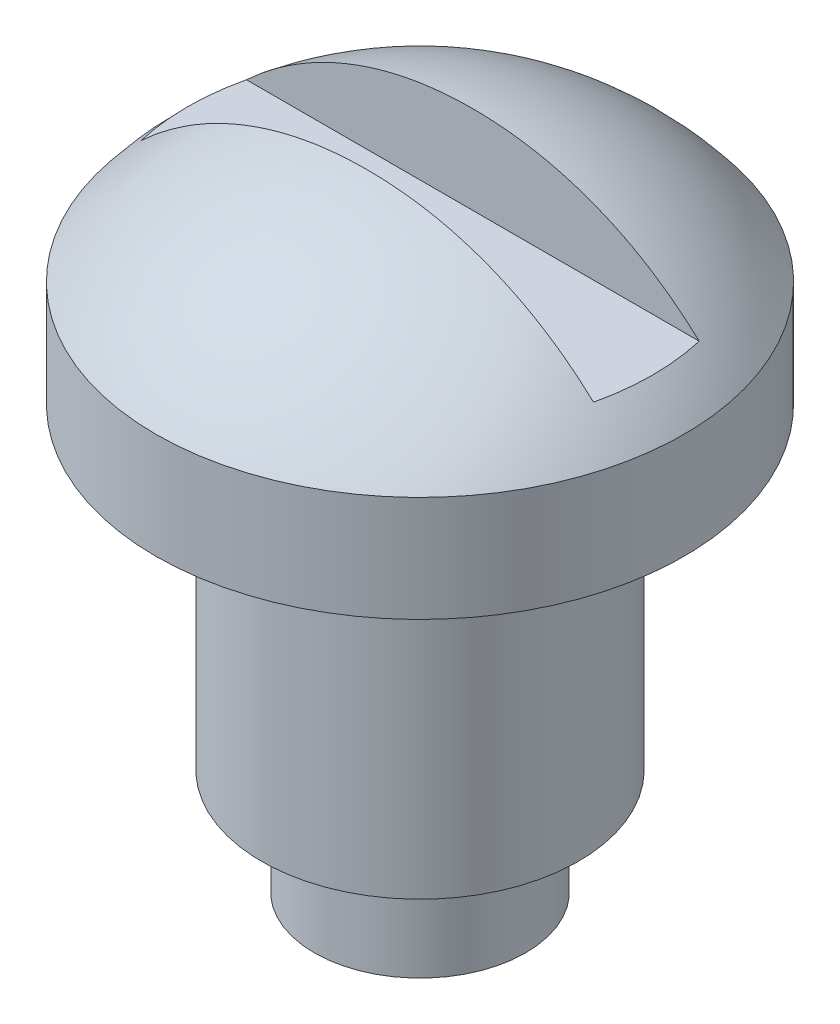
ISO-10303-21;
HEADER;
FILE_DESCRIPTION(('STEP AP214'),'2;1');
FILE_NAME('part.step','',(''),(''),'','','');
FILE_SCHEMA(('AUTOMOTIVE_DESIGN { 1 0 10303 214 1 1 1 1 }'));
ENDSEC;
DATA;
#1=APPLICATION_CONTEXT('core data for automotive mechanical design processes');
#2=APPLICATION_PROTOCOL_DEFINITION('international standard','automotive_design',2000,#1);
#3=PRODUCT_CONTEXT('',#1,'mechanical');
#4=PRODUCT('Part','Part','',(#3));
#5=PRODUCT_RELATED_PRODUCT_CATEGORY('part','',(#4));
#6=PRODUCT_DEFINITION_FORMATION('','',#4);
#7=PRODUCT_DEFINITION_CONTEXT('part definition',#1,'design');
#8=PRODUCT_DEFINITION('design','',#6,#7);
#9=PRODUCT_DEFINITION_SHAPE('','',#8);
#10=(LENGTH_UNIT() NAMED_UNIT(*) SI_UNIT(.MILLI.,.METRE.));
#11=(NAMED_UNIT(*) PLANE_ANGLE_UNIT() SI_UNIT($,.RADIAN.));
#12=(NAMED_UNIT(*) SI_UNIT($,.STERADIAN.) SOLID_ANGLE_UNIT());
#13=UNCERTAINTY_MEASURE_WITH_UNIT(LENGTH_MEASURE(1.E-05),#10,'distance_accuracy_value','');
#14=(GEOMETRIC_REPRESENTATION_CONTEXT(3) GLOBAL_UNCERTAINTY_ASSIGNED_CONTEXT((#13)) GLOBAL_UNIT_ASSIGNED_CONTEXT((#10,
#11,#12)) REPRESENTATION_CONTEXT('',''));
#15=CARTESIAN_POINT('',(0.,0.,0.));
#16=DIRECTION('',(0.,0.,1.));
#17=DIRECTION('',(1.,0.,0.));
#18=AXIS2_PLACEMENT_3D('',#15,#16,#17);
#19=CARTESIAN_POINT('',(0.,6.20081280988914,0.));
#20=DIRECTION('',(0.,-1.,0.));
#21=DIRECTION('',(0.,0.,-1.));
#22=AXIS2_PLACEMENT_3D('',#19,#20,#21);
#23=DEGENERATE_TOROIDAL_SURFACE('',#22,0.100390148746788,6.2,.T.);
#24=CARTESIAN_POINT('',(0.,10.,0.));
#25=DIRECTION('',(0.,-1.,0.));
#26=DIRECTION('',(0.,0.,-1.));
#27=AXIS2_PLACEMENT_3D('',#24,#25,#26);
#28=CIRCLE('',#27,5.);
#29=CARTESIAN_POINT('',(0.,10.,-5.));
#30=VERTEX_POINT('',#29);
#31=EDGE_CURVE('E76',#30,#30,#28,.T.);
#32=ORIENTED_EDGE('',*,*,#31,.F.);
#33=EDGE_LOOP('',(#32));
#34=FACE_BOUND('',#33,.T.);
#35=CARTESIAN_POINT('',(-2.61237037580595,11.7835604228593,-1.));
#36=CARTESIAN_POINT('',(-2.45382282538688,11.8550890441978,-1.));
#37=CARTESIAN_POINT('',(-2.29225280769405,11.9198766114603,-1.));
#38=CARTESIAN_POINT('',(-1.96421876722474,12.0355643245258,-1.));
#39=CARTESIAN_POINT('',(-1.79775503524373,12.0864652936613,-1.));
#40=CARTESIAN_POINT('',(-1.4607970651705,12.1742007818954,-1.));
#41=CARTESIAN_POINT('',(-1.29029516516596,12.2110058283417,-1.));
#42=CARTESIAN_POINT('',(-0.94683377857503,12.2703524347939,-1.));
#43=CARTESIAN_POINT('',(-0.773874260330649,12.2928938108907,-1.));
#44=CARTESIAN_POINT('',(-0.425657388377293,12.3241854876249,-1.));
#45=CARTESIAN_POINT('',(-0.250392442994169,12.3328499748018,-1.));
#46=CARTESIAN_POINT('',(0.100289915669181,12.3367231669148,-1.));
#47=CARTESIAN_POINT('',(0.275707335981193,12.3319312143195,-1.));
#48=CARTESIAN_POINT('',(0.625533362381513,12.3084994279706,-1.));
#49=CARTESIAN_POINT('',(0.799942492464325,12.2898675913701,-1.));
#50=CARTESIAN_POINT('',(1.14661264919242,12.2382300013575,-1.));
#51=CARTESIAN_POINT('',(1.31887389072011,12.2052256978806,-1.));
#52=CARTESIAN_POINT('',(1.66921885918353,12.1226293355474,-1.));
#53=CARTESIAN_POINT('',(1.84711498915365,12.072238086888,-1.));
#54=CARTESIAN_POINT('',(2.19769774738319,11.9556992391668,-1.));
#55=CARTESIAN_POINT('',(2.37038362945118,11.8895493951749,-1.));
#56=CARTESIAN_POINT('',(2.70910778153963,11.7419735468425,-1.));
#57=CARTESIAN_POINT('',(2.87514582456367,11.6605470214049,-1.));
#58=CARTESIAN_POINT('',(3.19919168571218,11.4830588529782,-1.));
#59=CARTESIAN_POINT('',(3.35720022216488,11.3869985222295,-1.));
#60=CARTESIAN_POINT('',(3.65432272918018,11.1874447957869,-1.));
#61=CARTESIAN_POINT('',(3.79400046819442,11.0847893801181,-1.));
#62=CARTESIAN_POINT('',(4.06421129063088,10.867979701022,-1.));
#63=CARTESIAN_POINT('',(4.19474117443749,10.7538214479826,-1.));
#64=CARTESIAN_POINT('',(4.44559886917584,10.5149101654858,-1.));
#65=CARTESIAN_POINT('',(4.56593136829595,10.3901620580381,-1.));
#66=CARTESIAN_POINT('',(4.79563755966596,10.1308714013775,-1.));
#67=CARTESIAN_POINT('',(4.90500720434009,9.99632526607488,-1.));
#68=CARTESIAN_POINT('',(5.11134382797234,9.71925752680546,-1.));
#69=CARTESIAN_POINT('',(5.20837941605125,9.57678700913662,-1.));
#70=CARTESIAN_POINT('',(5.39013109431643,9.28412033326316,-1.));
#71=CARTESIAN_POINT('',(5.47484264493493,9.1339213557133,-1.));
#72=CARTESIAN_POINT('',(5.63126728087798,8.82697779726688,-1.));
#73=CARTESIAN_POINT('',(5.70298562812034,8.67023589787223,-1.));
#74=CARTESIAN_POINT('',(5.83297903520153,8.35120561371858,-1.));
#75=CARTESIAN_POINT('',(5.89124912434938,8.18891520350668,-1.));
#76=CARTESIAN_POINT('',(5.99384129037307,7.86017518411423,-1.));
#77=CARTESIAN_POINT('',(6.03817824838982,7.69373021873843,-1.));
#78=CARTESIAN_POINT('',(6.11268720252436,7.35763480774286,-1.));
#79=CARTESIAN_POINT('',(6.14285396199065,7.1879832011514,-1.));
#80=CARTESIAN_POINT('',(6.18877543933646,6.84680016639743,-1.));
#81=CARTESIAN_POINT('',(6.2045351190965,6.67526940603885,-1.));
#82=CARTESIAN_POINT('',(6.22155129918386,6.33142553396434,-1.));
#83=CARTESIAN_POINT('',(6.22280236916714,6.15911215346403,-1.));
#84=CARTESIAN_POINT('',(6.21078183902495,5.81509226509558,-1.));
#85=CARTESIAN_POINT('',(6.19751860823098,5.6433854647064,-1.));
#86=CARTESIAN_POINT('',(6.1565678431201,5.30162159375661,-1.));
#87=CARTESIAN_POINT('',(6.12887377653486,5.13156530585717,-1.));
#88=CARTESIAN_POINT('',(6.05925621396793,4.79439810866241,-1.));
#89=CARTESIAN_POINT('',(6.01733330878051,4.62728707738037,-1.));
#90=CARTESIAN_POINT('',(5.91957854633249,4.29726637071842,-1.));
#91=CARTESIAN_POINT('',(5.86375299634464,4.13435482702257,-1.));
#92=CARTESIAN_POINT('',(5.73855601781616,3.81374892612541,-1.));
#93=CARTESIAN_POINT('',(5.66917928878027,3.65605663873432,-1.));
#94=CARTESIAN_POINT('',(5.5174163777287,3.34713502840521,-1.));
#95=CARTESIAN_POINT('',(5.43503506867632,3.19590331148161,-1.));
#96=CARTESIAN_POINT('',(5.25778854705118,2.90084405492901,-1.));
#97=CARTESIAN_POINT('',(5.16291744564249,2.75702005275908,-1.));
#98=CARTESIAN_POINT('',(4.96143456651403,2.47792635225774,-1.));
#99=CARTESIAN_POINT('',(4.85482712988464,2.34265351993061,-1.));
#100=CARTESIAN_POINT('',(4.6305306656051,2.08148066721675,-1.));
#101=CARTESIAN_POINT('',(4.51283464580676,1.9555866516502,-1.));
#102=CARTESIAN_POINT('',(4.26730259308499,1.7142036512217,-1.));
#103=CARTESIAN_POINT('',(4.13947030830414,1.59871085367293,-1.));
#104=CARTESIAN_POINT('',(3.87452163126147,1.37888032774053,-1.));
#105=CARTESIAN_POINT('',(3.73740404791095,1.27454403492207,-1.));
#106=CARTESIAN_POINT('',(3.45492878166863,1.07781406201076,-1.));
#107=CARTESIAN_POINT('',(3.3095741357438,0.985416021024321,-1.));
#108=CARTESIAN_POINT('',(3.01144157881078,0.813061759054482,-1.));
#109=CARTESIAN_POINT('',(2.85865524795669,0.733120102856962,-1.));
#110=CARTESIAN_POINT('',(2.54696387804005,0.586382043556859,-1.));
#111=CARTESIAN_POINT('',(2.38806106874604,0.519580903327315,-1.));
#112=CARTESIAN_POINT('',(2.06513470688729,0.399491373249309,-1.));
#113=CARTESIAN_POINT('',(1.90110849529788,0.346210135581787,-1.));
#114=CARTESIAN_POINT('',(1.5692455729522,0.253519570721612,-1.));
#115=CARTESIAN_POINT('',(1.40141016504523,0.214105574454103,-1.));
#116=CARTESIAN_POINT('',(1.06215827195792,0.149050511107759,-1.));
#117=CARTESIAN_POINT('',(0.890727354104403,0.123484878385291,-1.));
#118=CARTESIAN_POINT('',(0.546355247617415,0.0861995570450816,-1.));
#119=CARTESIAN_POINT('',(0.373413803270475,0.0744822604099826,-1.));
#120=CARTESIAN_POINT('',(0.0270775775518827,0.0642579361220109,-1.));
#121=CARTESIAN_POINT('',(-0.146317363956651,0.0657564692472337,-1.));
#122=CARTESIAN_POINT('',(-0.492473261039021,0.0821054443909234,-1.));
#123=CARTESIAN_POINT('',(-0.665234271876585,0.0969546933740604,-1.));
#124=CARTESIAN_POINT('',(-1.02113310718087,0.142166708836785,-1.));
#125=CARTESIAN_POINT('',(-1.20414338821634,0.17354979917317,-1.));
#126=CARTESIAN_POINT('',(-1.56665718479694,0.252493620765257,-1.));
#127=CARTESIAN_POINT('',(-1.74616047621129,0.30005538244251,-1.));
#128=CARTESIAN_POINT('',(-2.10001069616468,0.411084482262799,-1.));
#129=CARTESIAN_POINT('',(-2.27436196458994,0.474537980493747,-1.));
#130=CARTESIAN_POINT('',(-2.61669250238063,0.616951192129823,-1.));
#131=CARTESIAN_POINT('',(-2.78466941071003,0.695916585460378,-1.));
#132=CARTESIAN_POINT('',(-3.10328100801335,0.863712516176362,-1.));
#133=CARTESIAN_POINT('',(-3.25435668537386,0.951707149541059,-1.));
#134=CARTESIAN_POINT('',(-3.54844875087975,1.14026886361712,-1.));
#135=CARTESIAN_POINT('',(-3.69146522656724,1.24083580772508,-1.));
#136=CARTESIAN_POINT('',(-3.96841824880026,1.4538387477368,-1.));
#137=CARTESIAN_POINT('',(-4.10235275348132,1.56627739827634,-1.));
#138=CARTESIAN_POINT('',(-4.36012828326083,1.80219178575983,-1.));
#139=CARTESIAN_POINT('',(-4.48396904337742,1.92566781227962,-1.));
#140=CARTESIAN_POINT('',(-4.71903122311263,2.18100139743122,-1.));
#141=CARTESIAN_POINT('',(-4.83040146781093,2.31272199246409,-1.));
#142=CARTESIAN_POINT('',(-5.0416743212637,2.58513268924456,-1.));
#143=CARTESIAN_POINT('',(-5.14157299731609,2.72582584142182,-1.));
#144=CARTESIAN_POINT('',(-5.32909495751051,3.01506240253884,-1.));
#145=CARTESIAN_POINT('',(-5.41672466473192,3.1636016473504,-1.));
#146=CARTESIAN_POINT('',(-5.57917573209164,3.46759712502422,-1.));
#147=CARTESIAN_POINT('',(-5.65399235340974,3.62305589035154,-1.));
#148=CARTESIAN_POINT('',(-5.7901417426395,3.9394949045904,-1.));
#149=CARTESIAN_POINT('',(-5.85149444118922,4.1004665787412,-1.));
#150=CARTESIAN_POINT('',(-5.96044114426368,4.42706756482144,-1.));
#151=CARTESIAN_POINT('',(-6.0080299947478,4.59269859609514,-1.));
#152=CARTESIAN_POINT('',(-6.08906447318068,4.92732136222522,-1.));
#153=CARTESIAN_POINT('',(-6.12251521993561,5.09631185752013,-1.));
#154=CARTESIAN_POINT('',(-6.1750722182253,5.4365874573456,-1.));
#155=CARTESIAN_POINT('',(-6.1941719625513,5.60787356699664,-1.));
#156=CARTESIAN_POINT('',(-6.2178627183198,5.95140011412864,-1.));
#157=CARTESIAN_POINT('',(-6.22245761171482,6.12364028390921,-1.));
#158=CARTESIAN_POINT('',(-6.21711812388446,6.46781710592616,-1.));
#159=CARTESIAN_POINT('',(-6.20719032657169,6.63975386034217,-1.));
#160=CARTESIAN_POINT('',(-6.17288165844191,6.98224394258609,-1.));
#161=CARTESIAN_POINT('',(-6.14849541518042,7.15279673227112,-1.));
#162=CARTESIAN_POINT('',(-6.08545097066471,7.49117765390956,-1.));
#163=CARTESIAN_POINT('',(-6.04679811192872,7.65900678128222,-1.));
#164=CARTESIAN_POINT('',(-5.95548288225497,7.99085485045835,-1.));
#165=CARTESIAN_POINT('',(-5.90281700073203,8.15487282626915,-1.));
#166=CARTESIAN_POINT('',(-5.78387713885126,8.47782928561231,-1.));
#167=CARTESIAN_POINT('',(-5.71760818798558,8.63676962148333,-1.));
#168=CARTESIAN_POINT('',(-5.57187956663406,8.94859559656203,-1.));
#169=CARTESIAN_POINT('',(-5.49241229908417,9.10147768544957,-1.));
#170=CARTESIAN_POINT('',(-5.32091175263685,9.3999480917538,-1.));
#171=CARTESIAN_POINT('',(-5.2288831116385,9.54553907419289,-1.));
#172=CARTESIAN_POINT('',(-5.03280073134026,9.82858642041928,-1.));
#173=CARTESIAN_POINT('',(-4.92873584577963,9.9660350629403,-1.));
#174=CARTESIAN_POINT('',(-4.70943319341987,10.2316243364121,-1.));
#175=CARTESIAN_POINT('',(-4.59419950714537,10.3597683371103,-1.));
#176=CARTESIAN_POINT('',(-4.35343950586722,10.6058006846382,-1.));
#177=CARTESIAN_POINT('',(-4.2279212379481,10.7236969036752,-1.));
#178=CARTESIAN_POINT('',(-3.96745402155415,10.9484751455599,-1.));
#179=CARTESIAN_POINT('',(-3.83250765188762,11.0553601605919,-1.));
#180=CARTESIAN_POINT('',(-3.52440990209183,11.2789516880712,-1.));
#181=CARTESIAN_POINT('',(-3.34924502199823,11.3928976077583,-1.));
#182=CARTESIAN_POINT('',(-2.98828968281612,11.6023092160345,-1.));
#183=CARTESIAN_POINT('',(-2.80250336847671,11.6977820503726,-1.));
#184=CARTESIAN_POINT('',(-2.61237037580595,11.7835604228593,-1.));
#185=B_SPLINE_CURVE_WITH_KNOTS('',3,(#35,#36,#37,#38,#39,#40,#41,#42,#43,#44,#45,#46,#47,#48,
#49,#50,#51,#52,#53,#54,#55,#56,#57,#58,#59,#60,#61,#62,#63,#64,#65,#66,#67,#68,#69,#70,#71,#72,
#73,#74,#75,#76,#77,#78,#79,#80,#81,#82,#83,#84,#85,#86,#87,#88,#89,#90,#91,#92,#93,#94,#95,#96,
#97,#98,#99,#100,#101,#102,#103,#104,#105,#106,#107,#108,#109,#110,#111,#112,#113,#114,#115,
#116,#117,#118,#119,#120,#121,#122,#123,#124,#125,#126,#127,#128,#129,#130,#131,#132,#133,#134,
#135,#136,#137,#138,#139,#140,#141,#142,#143,#144,#145,#146,#147,#148,#149,#150,#151,#152,#153,
#154,#155,#156,#157,#158,#159,#160,#161,#162,#163,#164,#165,#166,#167,#168,#169,#170,#171,#172,
#173,#174,#175,#176,#177,#178,#179,#180,#181,#182,#183,#184),.UNSPECIFIED.,.T.,.F.,(4,2,2,2,2,2,
2,2,2,2,2,2,2,2,2,2,2,2,2,2,2,2,2,2,2,2,2,2,2,2,2,2,2,2,2,2,2,2,2,2,2,2,2,2,2,2,2,2,2,2,2,2,2,2,
2,2,2,2,2,2,2,2,2,2,2,2,2,2,2,2,2,2,2,2,4),(0.,0.52162227518856,1.04321361681522,
1.56588965722053,2.08857243662882,2.61447513104324,3.14040352345252,3.66602825281899,
4.19159996794679,4.74554010900442,5.29955921023021,5.85359721282877,6.40758556302246,
6.92700159166487,7.44659839731351,7.96595501051616,8.48550267356392,9.00202048969736,
9.5187280864034,10.0352259595933,10.5519144339956,11.0680491740428,11.5843745039015,
12.1005219413,12.6168625583195,13.1329055964285,13.6491824299824,14.1654378298764,
14.6814594432703,15.1976833023292,15.7137141836286,16.2299892465586,16.7460739848268,
17.2624863579175,17.7787086569727,18.2949973012893,18.8110968154156,19.3277953289153,
19.8443072310008,20.3610918067154,20.8777022151169,21.3970990896837,21.9165856650502,
22.4362908333768,22.955949564867,23.512260708605,24.0686072905037,24.6244710318578,
25.1805386921813,25.7044103916849,26.2282763995983,26.7522597984332,27.2762569484981,
27.7931216395524,28.3101629973336,28.8269326520912,29.3438930192743,29.860082889526,
30.3764658038437,30.8926615973777,31.4090913097692,31.9253827976677,32.4414402955425,
32.9576896694586,33.4737459157166,33.9899315678856,34.5059267122729,35.0222199038424,
35.5383229831627,36.0549078894365,36.571304767637,37.0873013847477,37.6031574130237,
38.2289385097988,38.8544770562045),.UNSPECIFIED.);
#186=CARTESIAN_POINT('',(-4.28429457024648,10.6682578494913,-1.));
#187=VERTEX_POINT('',#186);
#188=CARTESIAN_POINT('',(4.28429457024648,10.6682578494913,-1.));
#189=VERTEX_POINT('',#188);
#190=EDGE_CURVE('E59',#187,#189,#185,.T.);
#191=ORIENTED_EDGE('',*,*,#190,.T.);
#192=CARTESIAN_POINT('',(0.,10.6682578494913,0.));
#193=DIRECTION('',(0.,1.,0.));
#194=DIRECTION('',(0.,0.,1.));
#195=AXIS2_PLACEMENT_3D('',#192,#193,#194);
#196=CIRCLE('',#195,4.39945223461324);
#197=CARTESIAN_POINT('',(4.28429457024648,10.6682578494913,1.));
#198=VERTEX_POINT('',#197);
#199=EDGE_CURVE('E74',#198,#189,#196,.T.);
#200=ORIENTED_EDGE('',*,*,#199,.F.);
#201=CARTESIAN_POINT('',(-2.61237037580595,11.7835604228593,1.));
#202=CARTESIAN_POINT('',(-2.76953013446622,11.7126616538096,1.));
#203=CARTESIAN_POINT('',(-2.92367512132521,11.6351581392118,1.));
#204=CARTESIAN_POINT('',(-3.22494424250824,11.4674274884413,1.));
#205=CARTESIAN_POINT('',(-3.37206684969643,11.3771976014232,1.));
#206=CARTESIAN_POINT('',(-3.65829991991208,11.184583651109,1.));
#207=CARTESIAN_POINT('',(-3.79740366312367,11.0821896079795,1.));
#208=CARTESIAN_POINT('',(-4.06652529172736,10.8659893050681,1.));
#209=CARTESIAN_POINT('',(-4.19653986102927,10.7521789166447,1.));
#210=CARTESIAN_POINT('',(-4.44635437421702,10.5141194715528,1.));
#211=CARTESIAN_POINT('',(-4.56616557385356,10.3898822257463,1.));
#212=CARTESIAN_POINT('',(-4.79492184436636,10.1316947313164,1.));
#213=CARTESIAN_POINT('',(-4.90386288556611,9.99774091220772,1.));
#214=CARTESIAN_POINT('',(-5.10998322290083,9.72120363225137,1.));
#215=CARTESIAN_POINT('',(-5.20716996019344,9.57862571763902,1.));
#216=CARTESIAN_POINT('',(-5.38920165250081,9.28572456424802,1.));
#217=CARTESIAN_POINT('',(-5.4740420409007,9.13539848731118,1.));
#218=CARTESIAN_POINT('',(-5.63058307403834,8.8284132359901,1.));
#219=CARTESIAN_POINT('',(-5.70230831388038,8.67176660262545,1.));
#220=CARTESIAN_POINT('',(-5.83233015569767,8.35292837040632,1.));
#221=CARTESIAN_POINT('',(-5.8906217952054,8.19073474778186,1.));
#222=CARTESIAN_POINT('',(-5.99331046011594,7.86206450555485,1.));
#223=CARTESIAN_POINT('',(-6.03771195214065,7.69558928145096,1.));
#224=CARTESIAN_POINT('',(-6.11234341538914,7.35942732295554,1.));
#225=CARTESIAN_POINT('',(-6.1425681454913,7.18973942492632,1.));
#226=CARTESIAN_POINT('',(-6.18858932228113,6.84854632114735,1.));
#227=CARTESIAN_POINT('',(-6.20439643451184,6.6770425538691,1.));
#228=CARTESIAN_POINT('',(-6.22151150217539,6.33324861063383,1.));
#229=CARTESIAN_POINT('',(-6.22281403039831,6.16095816444426,1.));
#230=CARTESIAN_POINT('',(-6.21089903401457,5.81695096598726,1.));
#231=CARTESIAN_POINT('',(-6.19768746543514,5.64523400737728,1.));
#232=CARTESIAN_POINT('',(-6.15683849522704,5.30344557438124,1.));
#233=CARTESIAN_POINT('',(-6.12919455941013,5.13337488088694,1.));
#234=CARTESIAN_POINT('',(-6.05967550743527,4.79617554325779,1.));
#235=CARTESIAN_POINT('',(-6.01780104268923,4.62904676482308,1.));
#236=CARTESIAN_POINT('',(-5.92014103940568,4.29898671134499,1.));
#237=CARTESIAN_POINT('',(-5.86436180986741,4.13605356950894,1.));
#238=CARTESIAN_POINT('',(-5.73925680112486,3.81540521616797,1.));
#239=CARTESIAN_POINT('',(-5.6699260907916,3.65769192857098,1.));
#240=CARTESIAN_POINT('',(-5.51825321323034,3.34872455627066,1.));
#241=CARTESIAN_POINT('',(-5.43591592024914,3.19746807872834,1.));
#242=CARTESIAN_POINT('',(-5.25876194401593,2.90236700656758,1.));
#243=CARTESIAN_POINT('',(-5.1639403236925,2.75852537571567,1.));
#244=CARTESIAN_POINT('',(-4.96255554966216,2.47939167010919,1.));
#245=CARTESIAN_POINT('',(-4.855996737623,2.34409646291985,1.));
#246=CARTESIAN_POINT('',(-4.6318066143536,2.08288618433385,1.));
#247=CARTESIAN_POINT('',(-4.51416932780523,1.95697624134713,1.));
#248=CARTESIAN_POINT('',(-4.26875474951989,1.71555470999595,1.));
#249=CARTESIAN_POINT('',(-4.14098120238977,1.60003931495622,1.));
#250=CARTESIAN_POINT('',(-3.8760402155095,1.38006626584059,1.));
#251=CARTESIAN_POINT('',(-3.73886395024665,1.27561924136626,1.));
#252=CARTESIAN_POINT('',(-3.45625710754308,1.07868131304224,1.));
#253=CARTESIAN_POINT('',(-3.31082957573247,0.986186038461787,1.));
#254=CARTESIAN_POINT('',(-3.01274247120871,0.813769947582478,1.));
#255=CARTESIAN_POINT('',(-2.86008438184039,0.733846566579666,1.));
#256=CARTESIAN_POINT('',(-2.54865448448198,0.587124846120135,1.));
#257=CARTESIAN_POINT('',(-2.38988490966581,0.520321765865855,1.));
#258=CARTESIAN_POINT('',(-2.06703803506578,0.400137221697751,1.));
#259=CARTESIAN_POINT('',(-1.9029521506886,0.346778825727535,1.));
#260=CARTESIAN_POINT('',(-1.5709606048746,0.253945431532434,1.));
#261=CARTESIAN_POINT('',(-1.40305625012743,0.214465757880043,1.));
#262=CARTESIAN_POINT('',(-1.06438842786513,0.149434034288514,1.));
#263=CARTESIAN_POINT('',(-0.893621964484864,0.123897656962984,1.));
#264=CARTESIAN_POINT('',(-0.550557797344773,0.0865571088909178,1.));
#265=CARTESIAN_POINT('',(-0.378259786384644,0.0747557587637779,1.));
#266=CARTESIAN_POINT('',(-0.116749725477367,0.0668406396936543,1.));
#267=CARTESIAN_POINT('',(-0.0276550763777773,0.0659001922612646,1.));
#268=CARTESIAN_POINT('',(0.15050126000954,0.0675050652442816,1.));
#269=CARTESIAN_POINT('',(0.239562947780622,0.0700503323397383,1.));
#270=CARTESIAN_POINT('',(0.50646921698554,0.083003124150141,1.));
#271=CARTESIAN_POINT('',(0.68409063573613,0.098725911403814,1.));
#272=CARTESIAN_POINT('',(1.03727847680897,0.144931043055646,1.));
#273=CARTESIAN_POINT('',(1.21284619769764,0.175403479671435,1.));
#274=CARTESIAN_POINT('',(1.56074755831644,0.251248564664148,1.));
#275=CARTESIAN_POINT('',(1.73308113362178,0.296621509529652,1.));
#276=CARTESIAN_POINT('',(2.07698806362326,0.403250860665653,1.));
#277=CARTESIAN_POINT('',(2.24845868470853,0.464839037380593,1.));
#278=CARTESIAN_POINT('',(2.58527026894938,0.602971003164428,1.));
#279=CARTESIAN_POINT('',(2.750611138907,0.679515019514023,1.));
#280=CARTESIAN_POINT('',(3.07389726048473,0.847013928886992,1.));
#281=CARTESIAN_POINT('',(3.23183994703454,0.937973772893433,1.));
#282=CARTESIAN_POINT('',(3.53900237225522,1.13357830260712,1.));
#283=CARTESIAN_POINT('',(3.68822259695505,1.23822222476269,1.));
#284=CARTESIAN_POINT('',(3.96940116420893,1.45471039765208,1.));
#285=CARTESIAN_POINT('',(4.10185161679123,1.56591633468932,1.));
#286=CARTESIAN_POINT('',(4.35692455980143,1.79916358097327,1.));
#287=CARTESIAN_POINT('',(4.47954382450615,1.92120841912554,1.));
#288=CARTESIAN_POINT('',(4.7139541170938,2.17515518824203,1.));
#289=CARTESIAN_POINT('',(4.82575141322442,2.3070513337883,1.));
#290=CARTESIAN_POINT('',(5.03783656706516,2.57987200429023,1.));
#291=CARTESIAN_POINT('',(5.13812017371303,2.72079983417348,1.));
#292=CARTESIAN_POINT('',(5.32606517302676,3.01010031422378,1.));
#293=CARTESIAN_POINT('',(5.41377142876951,3.15844382202381,1.));
#294=CARTESIAN_POINT('',(5.57640167470215,3.46205007626505,1.));
#295=CARTESIAN_POINT('',(5.65132094678908,3.61731535014343,1.));
#296=CARTESIAN_POINT('',(5.78778016867733,3.93355516112538,1.));
#297=CARTESIAN_POINT('',(5.84932466296181,4.09452773730963,1.));
#298=CARTESIAN_POINT('',(5.95864839108645,4.42114747917068,1.));
#299=CARTESIAN_POINT('',(6.00642253636553,4.58679634811673,1.));
#300=CARTESIAN_POINT('',(6.08779704990877,4.9213781494905,1.));
#301=CARTESIAN_POINT('',(6.12141040840164,5.09030792272112,1.));
#302=CARTESIAN_POINT('',(6.17429732784205,5.43046123243593,1.));
#303=CARTESIAN_POINT('',(6.19356560867202,5.60168558992433,1.));
#304=CARTESIAN_POINT('',(6.21760061455096,5.94508893422134,1.));
#305=CARTESIAN_POINT('',(6.22237239880995,6.11726756697093,1.));
#306=CARTESIAN_POINT('',(6.21739390991926,6.46147473964077,1.));
#307=CARTESIAN_POINT('',(6.20763858612897,6.63350320654432,1.));
#308=CARTESIAN_POINT('',(6.17367087976165,6.97607815943759,1.));
#309=CARTESIAN_POINT('',(6.14946254524917,7.14662504683009,1.));
#310=CARTESIAN_POINT('',(6.08676449519221,7.48507317220452,1.));
#311=CARTESIAN_POINT('',(6.04827477968083,7.65297441019257,1.));
#312=CARTESIAN_POINT('',(5.95728227660115,7.98495831394431,1.));
#313=CARTESIAN_POINT('',(5.90477774617132,8.1490405020156,1.));
#314=CARTESIAN_POINT('',(5.78615231633068,8.47214185769954,1.));
#315=CARTESIAN_POINT('',(5.72003615431918,8.63116276466979,1.));
#316=CARTESIAN_POINT('',(5.57462198296136,8.94312483351175,1.));
#317=CARTESIAN_POINT('',(5.49531949611413,9.09606390832545,1.));
#318=CARTESIAN_POINT('',(5.32414473583218,9.39466322950321,1.));
#319=CARTESIAN_POINT('',(5.23227709230036,9.54032613006559,1.));
#320=CARTESIAN_POINT('',(5.03655196269826,9.82347414334887,1.));
#321=CARTESIAN_POINT('',(4.93268819456798,9.96095491367724,1.));
#322=CARTESIAN_POINT('',(4.71379015588716,10.2266303583657,1.));
#323=CARTESIAN_POINT('',(4.59876001162704,10.3548284325995,1.));
#324=CARTESIAN_POINT('',(4.35822316458456,10.6011811400761,1.));
#325=CARTESIAN_POINT('',(4.23270844243234,10.7193279433558,1.));
#326=CARTESIAN_POINT('',(3.97222252168617,10.9445891067509,1.));
#327=CARTESIAN_POINT('',(3.83725481784329,11.0517075082494,1.));
#328=CARTESIAN_POINT('',(3.55879610754203,11.2541976289304,1.));
#329=CARTESIAN_POINT('',(3.41530584047322,11.3495703649282,1.));
#330=CARTESIAN_POINT('',(3.12086843148252,11.5278801666785,1.));
#331=CARTESIAN_POINT('',(2.96992403243068,11.6108217620059,1.));
#332=CARTESIAN_POINT('',(2.66142201109972,11.763831597227,1.));
#333=CARTESIAN_POINT('',(2.50385672535023,11.8338843847257,1.));
#334=CARTESIAN_POINT('',(2.18346523234388,11.9605074801139,1.));
#335=CARTESIAN_POINT('',(2.0206409201911,12.0170825845049,1.));
#336=CARTESIAN_POINT('',(1.69067904298596,12.1164966104079,1.));
#337=CARTESIAN_POINT('',(1.52353738543501,12.1593219402274,1.));
#338=CARTESIAN_POINT('',(1.18629375549495,12.2310043717086,1.));
#339=CARTESIAN_POINT('',(1.01619182905984,12.2598616900041,1.));
#340=CARTESIAN_POINT('',(0.672306160065901,12.3039893857779,1.));
#341=CARTESIAN_POINT('',(0.498502523073004,12.319103510511,1.));
#342=CARTESIAN_POINT('',(0.150229823714594,12.3358134230102,1.));
#343=CARTESIAN_POINT('',(-0.0242393627033775,12.3374065536736,1.));
#344=CARTESIAN_POINT('',(-0.372618674382786,12.3272109915988,1.));
#345=CARTESIAN_POINT('',(-0.546529193575379,12.3154362974498,1.));
#346=CARTESIAN_POINT('',(-0.892766795303796,12.2778906885712,1.));
#347=CARTESIAN_POINT('',(-1.06509446289764,12.252125175851,1.));
#348=CARTESIAN_POINT('',(-1.47285523006778,12.173660041099,1.));
#349=CARTESIAN_POINT('',(-1.70706144424065,12.1144120037895,1.));
#350=CARTESIAN_POINT('',(-2.16693327243252,11.9689333151029,1.));
#351=CARTESIAN_POINT('',(-2.39259951515168,11.8827046543483,1.));
#352=CARTESIAN_POINT('',(-2.61237037580595,11.7835604228593,1.));
#353=B_SPLINE_CURVE_WITH_KNOTS('',3,(#201,#202,#203,#204,#205,#206,#207,#208,#209,#210,#211,
#212,#213,#214,#215,#216,#217,#218,#219,#220,#221,#222,#223,#224,#225,#226,#227,#228,#229,#230,
#231,#232,#233,#234,#235,#236,#237,#238,#239,#240,#241,#242,#243,#244,#245,#246,#247,#248,#249,
#250,#251,#252,#253,#254,#255,#256,#257,#258,#259,#260,#261,#262,#263,#264,#265,#266,#267,#268,
#269,#270,#271,#272,#273,#274,#275,#276,#277,#278,#279,#280,#281,#282,#283,#284,#285,#286,#287,
#288,#289,#290,#291,#292,#293,#294,#295,#296,#297,#298,#299,#300,#301,#302,#303,#304,#305,#306,
#307,#308,#309,#310,#311,#312,#313,#314,#315,#316,#317,#318,#319,#320,#321,#322,#323,#324,#325,
#326,#327,#328,#329,#330,#331,#332,#333,#334,#335,#336,#337,#338,#339,#340,#341,#342,#343,#344,
#345,#346,#347,#348,#349,#350,#351,#352),.UNSPECIFIED.,.T.,.F.,(4,2,2,2,2,2,2,2,2,2,2,2,2,2,2,2,
2,2,2,2,2,2,2,2,2,2,2,2,2,2,2,2,2,2,2,2,2,2,2,2,2,2,2,2,2,2,2,2,2,2,2,2,2,2,2,2,2,2,2,2,2,2,2,2,
2,2,2,2,2,2,2,2,2,2,2,4),(0.,0.51702696862736,1.03416586601825,1.55173200825205,
2.06948600413587,2.58666123933709,3.10402748977815,3.6210644836748,4.1382922335736,
4.65453983874229,5.17097784484634,5.68724961008677,6.20371208985968,6.71979220196294,
7.2360654103339,7.75212683914172,8.26842211527556,8.78469376083255,9.3007315838261,
9.81695753403133,10.3329904843238,10.8492281222241,11.3652754375393,11.8816027013754,
12.3977401004684,12.9143687680915,13.4308079677072,13.9471416751591,14.4632884695717,
14.9803149119441,15.4971670125206,16.0145988780584,16.5321369844471,16.7993774677172,
17.0666138631339,17.6009201451108,18.1348680145562,18.668826509078,19.214697393114,
19.7605765732784,20.3066436385086,20.8526802469808,21.3709020513924,21.8892932002182,
22.407382269512,22.9256620156459,23.4420444597493,23.9586170271198,24.475013798034,
24.9916011492699,25.5077135779143,26.0240158827573,26.5401379797808,27.0564395589063,
27.5725965977478,28.0887536353924,28.6049748914869,29.1210167844838,29.6372342619772,
30.1532620378864,30.6695612800024,31.1856704560625,31.7021780695491,32.2184957288559,
32.7347686593847,33.2508530141367,33.7675521271307,34.2840670791787,34.801091046942,
35.3181069957838,35.8409302003121,36.3638561460096,36.8862349960511,37.4084122931248,
38.131471712969,38.8544777982757),.UNSPECIFIED.);
#354=CARTESIAN_POINT('',(-4.28429457024648,10.6682578494913,1.));
#355=VERTEX_POINT('',#354);
#356=EDGE_CURVE('E65',#198,#355,#353,.T.);
#357=ORIENTED_EDGE('',*,*,#356,.T.);
#358=CARTESIAN_POINT('',(0.,10.6682578494913,0.));
#359=DIRECTION('',(0.,-1.,0.));
#360=DIRECTION('',(0.,0.,-1.));
#361=AXIS2_PLACEMENT_3D('',#358,#359,#360);
#362=CIRCLE('',#361,4.39945223461324);
#363=EDGE_CURVE('E75',#355,#187,#362,.T.);
#364=ORIENTED_EDGE('',*,*,#363,.T.);
#365=EDGE_LOOP('',(#191,#200,#357,#364));
#366=FACE_BOUND('',#365,.T.);
#367=ADVANCED_FACE('F38',(#34,#366),#23,.T.);
#368=CARTESIAN_POINT('',(0.,0.,0.));
#369=DIRECTION('',(0.,-1.,0.));
#370=DIRECTION('',(0.,0.,-1.));
#371=AXIS2_PLACEMENT_3D('',#368,#369,#370);
#372=PLANE('',#371);
#373=CARTESIAN_POINT('',(0.,0.,0.));
#374=DIRECTION('',(0.,-1.,0.));
#375=DIRECTION('',(0.,0.,-1.));
#376=AXIS2_PLACEMENT_3D('',#373,#374,#375);
#377=CIRCLE('',#376,2.);
#378=CARTESIAN_POINT('',(0.,0.,-2.));
#379=VERTEX_POINT('',#378);
#380=EDGE_CURVE('E11',#379,#379,#377,.T.);
#381=ORIENTED_EDGE('',*,*,#380,.T.);
#382=EDGE_LOOP('',(#381));
#383=FACE_BOUND('',#382,.T.);
#384=ADVANCED_FACE('F40',(#383),#372,.T.);
#385=CARTESIAN_POINT('',(0.,0.,0.));
#386=DIRECTION('',(0.,-1.,0.));
#387=DIRECTION('',(0.,0.,-1.));
#388=AXIS2_PLACEMENT_3D('',#385,#386,#387);
#389=CYLINDRICAL_SURFACE('',#388,2.);
#390=CARTESIAN_POINT('',(0.,2.,0.));
#391=DIRECTION('',(0.,-1.,0.));
#392=DIRECTION('',(0.,0.,-1.));
#393=AXIS2_PLACEMENT_3D('',#390,#391,#392);
#394=CIRCLE('',#393,2.);
#395=CARTESIAN_POINT('',(0.,2.,-2.));
#396=VERTEX_POINT('',#395);
#397=EDGE_CURVE('E46',#396,#396,#394,.T.);
#398=ORIENTED_EDGE('',*,*,#397,.T.);
#399=EDGE_LOOP('',(#398));
#400=FACE_BOUND('',#399,.T.);
#401=ORIENTED_EDGE('',*,*,#380,.F.);
#402=EDGE_LOOP('',(#401));
#403=FACE_BOUND('',#402,.T.);
#404=ADVANCED_FACE('F109',(#400,#403),#389,.T.);
#405=CARTESIAN_POINT('',(2.,2.,0.));
#406=DIRECTION('',(0.,-1.,0.));
#407=DIRECTION('',(0.,0.,-1.));
#408=AXIS2_PLACEMENT_3D('',#405,#406,#407);
#409=PLANE('',#408);
#410=CARTESIAN_POINT('',(0.,2.,0.));
#411=DIRECTION('',(0.,-1.,0.));
#412=DIRECTION('',(0.,0.,-1.));
#413=AXIS2_PLACEMENT_3D('',#410,#411,#412);
#414=CIRCLE('',#413,3.);
#415=CARTESIAN_POINT('',(0.,2.,-3.));
#416=VERTEX_POINT('',#415);
#417=EDGE_CURVE('E122',#416,#416,#414,.T.);
#418=ORIENTED_EDGE('',*,*,#417,.T.);
#419=EDGE_LOOP('',(#418));
#420=FACE_BOUND('',#419,.T.);
#421=ORIENTED_EDGE('',*,*,#397,.F.);
#422=EDGE_LOOP('',(#421));
#423=FACE_BOUND('',#422,.T.);
#424=ADVANCED_FACE('F129',(#420,#423),#409,.T.);
#425=CARTESIAN_POINT('',(0.,0.,0.));
#426=DIRECTION('',(0.,-1.,0.));
#427=DIRECTION('',(0.,0.,-1.));
#428=AXIS2_PLACEMENT_3D('',#425,#426,#427);
#429=CYLINDRICAL_SURFACE('',#428,3.);
#430=CARTESIAN_POINT('',(0.,8.,0.));
#431=DIRECTION('',(0.,-1.,0.));
#432=DIRECTION('',(0.,0.,-1.));
#433=AXIS2_PLACEMENT_3D('',#430,#431,#432);
#434=CIRCLE('',#433,3.);
#435=CARTESIAN_POINT('',(0.,8.,-3.));
#436=VERTEX_POINT('',#435);
#437=EDGE_CURVE('E117',#436,#436,#434,.T.);
#438=ORIENTED_EDGE('',*,*,#437,.T.);
#439=EDGE_LOOP('',(#438));
#440=FACE_BOUND('',#439,.T.);
#441=ORIENTED_EDGE('',*,*,#417,.F.);
#442=EDGE_LOOP('',(#441));
#443=FACE_BOUND('',#442,.T.);
#444=ADVANCED_FACE('F131',(#440,#443),#429,.T.);
#445=CARTESIAN_POINT('',(3.,8.,0.));
#446=DIRECTION('',(0.,-1.,0.));
#447=DIRECTION('',(0.,0.,-1.));
#448=AXIS2_PLACEMENT_3D('',#445,#446,#447);
#449=PLANE('',#448);
#450=CARTESIAN_POINT('',(0.,8.,0.));
#451=DIRECTION('',(0.,-1.,0.));
#452=DIRECTION('',(0.,0.,-1.));
#453=AXIS2_PLACEMENT_3D('',#450,#451,#452);
#454=CIRCLE('',#453,5.);
#455=CARTESIAN_POINT('',(0.,8.,-5.));
#456=VERTEX_POINT('',#455);
#457=EDGE_CURVE('E114',#456,#456,#454,.T.);
#458=ORIENTED_EDGE('',*,*,#457,.T.);
#459=EDGE_LOOP('',(#458));
#460=FACE_BOUND('',#459,.T.);
#461=ORIENTED_EDGE('',*,*,#437,.F.);
#462=EDGE_LOOP('',(#461));
#463=FACE_BOUND('',#462,.T.);
#464=ADVANCED_FACE('F138',(#460,#463),#449,.T.);
#465=CARTESIAN_POINT('',(0.,0.,0.));
#466=DIRECTION('',(0.,-1.,0.));
#467=DIRECTION('',(0.,0.,-1.));
#468=AXIS2_PLACEMENT_3D('',#465,#466,#467);
#469=CYLINDRICAL_SURFACE('',#468,5.);
#470=ORIENTED_EDGE('',*,*,#31,.T.);
#471=EDGE_LOOP('',(#470));
#472=FACE_BOUND('',#471,.T.);
#473=ORIENTED_EDGE('',*,*,#457,.F.);
#474=EDGE_LOOP('',(#473));
#475=FACE_BOUND('',#474,.T.);
#476=ADVANCED_FACE('F143',(#472,#475),#469,.T.);
#477=CARTESIAN_POINT('',(-5.03556617029731,10.6682578494913,-1.));
#478=DIRECTION('',(0.,-1.,0.));
#479=DIRECTION('',(0.,0.,-1.));
#480=AXIS2_PLACEMENT_3D('',#477,#478,#479);
#481=PLANE('',#480);
#482=DIRECTION('',(1.,0.,0.));
#483=VECTOR('',#482,1.);
#484=CARTESIAN_POINT('',(-5.03556617029731,10.6682578494913,1.));
#485=LINE('',#484,#483);
#486=EDGE_CURVE('E52',#355,#198,#485,.T.);
#487=ORIENTED_EDGE('',*,*,#486,.T.);
#488=ORIENTED_EDGE('',*,*,#199,.T.);
#489=DIRECTION('',(1.,0.,0.));
#490=VECTOR('',#489,1.);
#491=CARTESIAN_POINT('',(-5.03556617029731,10.6682578494913,-1.));
#492=LINE('',#491,#490);
#493=EDGE_CURVE('E79',#187,#189,#492,.T.);
#494=ORIENTED_EDGE('',*,*,#493,.F.);
#495=ORIENTED_EDGE('',*,*,#363,.F.);
#496=EDGE_LOOP('',(#487,#488,#494,#495));
#497=FACE_BOUND('',#496,.T.);
#498=ADVANCED_FACE('F73',(#497),#481,.F.);
#499=CARTESIAN_POINT('',(-5.03556617029731,10.6682578494913,-1.));
#500=DIRECTION('',(0.,0.,-1.));
#501=DIRECTION('',(-1.,0.,0.));
#502=AXIS2_PLACEMENT_3D('',#499,#500,#501);
#503=PLANE('',#502);
#504=ORIENTED_EDGE('',*,*,#493,.T.);
#505=ORIENTED_EDGE('',*,*,#190,.F.);
#506=EDGE_LOOP('',(#504,#505));
#507=FACE_BOUND('',#506,.T.);
#508=ADVANCED_FACE('F87',(#507),#503,.F.);
#509=CARTESIAN_POINT('',(-5.03556617029731,10.6682578494913,1.));
#510=DIRECTION('',(0.,0.,1.));
#511=DIRECTION('',(1.,0.,0.));
#512=AXIS2_PLACEMENT_3D('',#509,#510,#511);
#513=PLANE('',#512);
#514=ORIENTED_EDGE('',*,*,#356,.F.);
#515=ORIENTED_EDGE('',*,*,#486,.F.);
#516=EDGE_LOOP('',(#514,#515));
#517=FACE_BOUND('',#516,.T.);
#518=ADVANCED_FACE('F66',(#517),#513,.F.);
#519=CLOSED_SHELL('',(#367,#384,#404,#424,#444,#464,#476,#498,#508,#518));
#520=MANIFOLD_SOLID_BREP('B2',#519);
#521=ADVANCED_BREP_SHAPE_REPRESENTATION('',(#18,#520),#14);
#522=SHAPE_DEFINITION_REPRESENTATION(#9,#521);
ENDSEC;
END-ISO-10303-21;
